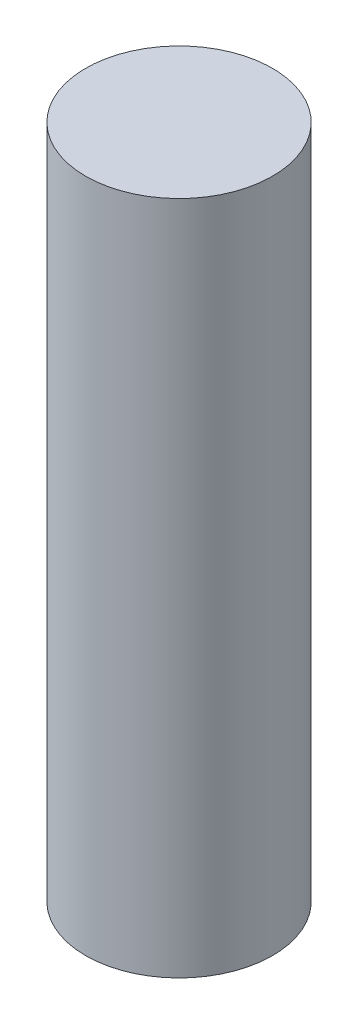
ISO-10303-21;
HEADER;
FILE_DESCRIPTION(('STEP AP214'),'2;1');
FILE_NAME('part.step','',(''),(''),'','','');
FILE_SCHEMA(('AUTOMOTIVE_DESIGN { 1 0 10303 214 1 1 1 1 }'));
ENDSEC;
DATA;
#1=APPLICATION_CONTEXT('core data for automotive mechanical design processes');
#2=APPLICATION_PROTOCOL_DEFINITION('international standard','automotive_design',2000,#1);
#3=PRODUCT_CONTEXT('',#1,'mechanical');
#4=PRODUCT('Part','Part','',(#3));
#5=PRODUCT_RELATED_PRODUCT_CATEGORY('part','',(#4));
#6=PRODUCT_DEFINITION_FORMATION('','',#4);
#7=PRODUCT_DEFINITION_CONTEXT('part definition',#1,'design');
#8=PRODUCT_DEFINITION('design','',#6,#7);
#9=PRODUCT_DEFINITION_SHAPE('','',#8);
#10=(LENGTH_UNIT() NAMED_UNIT(*) SI_UNIT(.MILLI.,.METRE.));
#11=(NAMED_UNIT(*) PLANE_ANGLE_UNIT() SI_UNIT($,.RADIAN.));
#12=(NAMED_UNIT(*) SI_UNIT($,.STERADIAN.) SOLID_ANGLE_UNIT());
#13=UNCERTAINTY_MEASURE_WITH_UNIT(LENGTH_MEASURE(1.E-05),#10,'distance_accuracy_value','');
#14=(GEOMETRIC_REPRESENTATION_CONTEXT(3) GLOBAL_UNCERTAINTY_ASSIGNED_CONTEXT((#13)) GLOBAL_UNIT_ASSIGNED_CONTEXT((#10,
#11,#12)) REPRESENTATION_CONTEXT('',''));
#15=CARTESIAN_POINT('',(0.,0.,0.));
#16=DIRECTION('',(0.,0.,1.));
#17=DIRECTION('',(1.,0.,0.));
#18=AXIS2_PLACEMENT_3D('',#15,#16,#17);
#19=CARTESIAN_POINT('',(0.,65.,0.));
#20=DIRECTION('',(0.,-1.,0.));
#21=DIRECTION('',(0.,0.,-1.));
#22=AXIS2_PLACEMENT_3D('',#19,#20,#21);
#23=CYLINDRICAL_SURFACE('',#22,9.);
#24=CARTESIAN_POINT('',(0.,65.,0.));
#25=DIRECTION('',(0.,1.,0.));
#26=DIRECTION('',(0.,0.,1.));
#27=AXIS2_PLACEMENT_3D('',#24,#25,#26);
#28=CIRCLE('',#27,9.);
#29=CARTESIAN_POINT('',(0.,65.,9.));
#30=VERTEX_POINT('',#29);
#31=EDGE_CURVE('E10',#30,#30,#28,.T.);
#32=ORIENTED_EDGE('',*,*,#31,.F.);
#33=EDGE_LOOP('',(#32));
#34=FACE_BOUND('',#33,.T.);
#35=CARTESIAN_POINT('',(0.,0.,0.));
#36=DIRECTION('',(0.,1.,0.));
#37=DIRECTION('',(0.,0.,1.));
#38=AXIS2_PLACEMENT_3D('',#35,#36,#37);
#39=CIRCLE('',#38,9.);
#40=CARTESIAN_POINT('',(0.,0.,9.));
#41=VERTEX_POINT('',#40);
#42=EDGE_CURVE('E40',#41,#41,#39,.T.);
#43=ORIENTED_EDGE('',*,*,#42,.T.);
#44=EDGE_LOOP('',(#43));
#45=FACE_BOUND('',#44,.T.);
#46=ADVANCED_FACE('F37',(#34,#45),#23,.T.);
#47=CARTESIAN_POINT('',(0.,65.,0.));
#48=DIRECTION('',(0.,1.,0.));
#49=DIRECTION('',(0.,0.,1.));
#50=AXIS2_PLACEMENT_3D('',#47,#48,#49);
#51=PLANE('',#50);
#52=ORIENTED_EDGE('',*,*,#31,.T.);
#53=EDGE_LOOP('',(#52));
#54=FACE_BOUND('',#53,.T.);
#55=ADVANCED_FACE('F54',(#54),#51,.T.);
#56=CARTESIAN_POINT('',(0.,0.,0.));
#57=DIRECTION('',(0.,1.,0.));
#58=DIRECTION('',(0.,0.,1.));
#59=AXIS2_PLACEMENT_3D('',#56,#57,#58);
#60=PLANE('',#59);
#61=ORIENTED_EDGE('',*,*,#42,.F.);
#62=EDGE_LOOP('',(#61));
#63=FACE_BOUND('',#62,.T.);
#64=ADVANCED_FACE('F52',(#63),#60,.F.);
#65=CLOSED_SHELL('',(#46,#55,#64));
#66=MANIFOLD_SOLID_BREP('B2',#65);
#67=ADVANCED_BREP_SHAPE_REPRESENTATION('',(#18,#66),#14);
#68=SHAPE_DEFINITION_REPRESENTATION(#9,#67);
ENDSEC;
END-ISO-10303-21;
